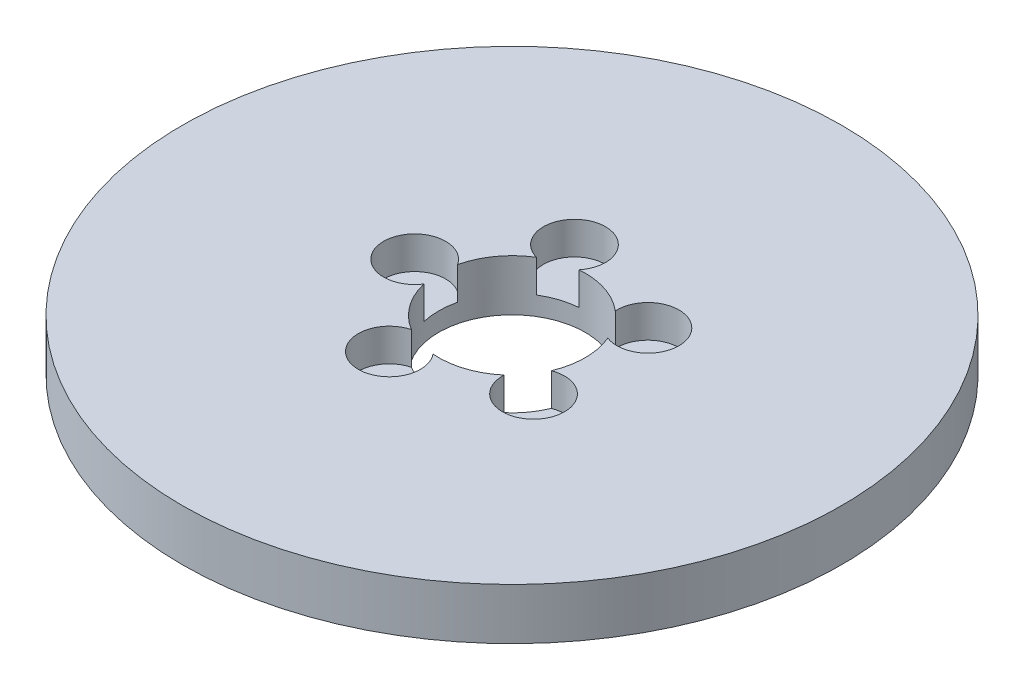
ISO-10303-21;
HEADER;
FILE_DESCRIPTION(('STEP AP214'),'2;1');
FILE_NAME('part.step','',(''),(''),'','','');
FILE_SCHEMA(('AUTOMOTIVE_DESIGN { 1 0 10303 214 1 1 1 1 }'));
ENDSEC;
DATA;
#1=APPLICATION_CONTEXT('core data for automotive mechanical design processes');
#2=APPLICATION_PROTOCOL_DEFINITION('international standard','automotive_design',2000,#1);
#3=PRODUCT_CONTEXT('',#1,'mechanical');
#4=PRODUCT('Part','Part','',(#3));
#5=PRODUCT_RELATED_PRODUCT_CATEGORY('part','',(#4));
#6=PRODUCT_DEFINITION_FORMATION('','',#4);
#7=PRODUCT_DEFINITION_CONTEXT('part definition',#1,'design');
#8=PRODUCT_DEFINITION('design','',#6,#7);
#9=PRODUCT_DEFINITION_SHAPE('','',#8);
#10=(LENGTH_UNIT() NAMED_UNIT(*) SI_UNIT(.MILLI.,.METRE.));
#11=(NAMED_UNIT(*) PLANE_ANGLE_UNIT() SI_UNIT($,.RADIAN.));
#12=(NAMED_UNIT(*) SI_UNIT($,.STERADIAN.) SOLID_ANGLE_UNIT());
#13=UNCERTAINTY_MEASURE_WITH_UNIT(LENGTH_MEASURE(1.E-05),#10,'distance_accuracy_value','');
#14=(GEOMETRIC_REPRESENTATION_CONTEXT(3) GLOBAL_UNCERTAINTY_ASSIGNED_CONTEXT((#13)) GLOBAL_UNIT_ASSIGNED_CONTEXT((#10,
#11,#12)) REPRESENTATION_CONTEXT('',''));
#15=CARTESIAN_POINT('',(0.,0.,0.));
#16=DIRECTION('',(0.,0.,1.));
#17=DIRECTION('',(1.,0.,0.));
#18=AXIS2_PLACEMENT_3D('',#15,#16,#17);
#19=CARTESIAN_POINT('',(0.,7.,0.));
#20=DIRECTION('',(0.,-1.,0.));
#21=DIRECTION('',(0.,0.,-1.));
#22=AXIS2_PLACEMENT_3D('',#19,#20,#21);
#23=CYLINDRICAL_SURFACE('',#22,45.);
#24=CARTESIAN_POINT('',(0.,7.,0.));
#25=DIRECTION('',(0.,1.,0.));
#26=DIRECTION('',(0.,0.,1.));
#27=AXIS2_PLACEMENT_3D('',#24,#25,#26);
#28=CIRCLE('',#27,45.);
#29=CARTESIAN_POINT('',(0.,7.,45.));
#30=VERTEX_POINT('',#29);
#31=EDGE_CURVE('E157',#30,#30,#28,.T.);
#32=ORIENTED_EDGE('',*,*,#31,.F.);
#33=EDGE_LOOP('',(#32));
#34=FACE_BOUND('',#33,.T.);
#35=CARTESIAN_POINT('',(0.,0.,0.));
#36=DIRECTION('',(0.,1.,0.));
#37=DIRECTION('',(0.,0.,1.));
#38=AXIS2_PLACEMENT_3D('',#35,#36,#37);
#39=CIRCLE('',#38,45.);
#40=CARTESIAN_POINT('',(0.,0.,45.));
#41=VERTEX_POINT('',#40);
#42=EDGE_CURVE('E150',#41,#41,#39,.T.);
#43=ORIENTED_EDGE('',*,*,#42,.T.);
#44=EDGE_LOOP('',(#43));
#45=FACE_BOUND('',#44,.T.);
#46=ADVANCED_FACE('F39',(#34,#45),#23,.T.);
#47=CARTESIAN_POINT('',(0.,7.,0.));
#48=DIRECTION('',(0.,1.,0.));
#49=DIRECTION('',(0.,0.,1.));
#50=AXIS2_PLACEMENT_3D('',#47,#48,#49);
#51=PLANE('',#50);
#52=CARTESIAN_POINT('',(-4.10640109321556,7.,-12.6382030416275));
#53=DIRECTION('',(0.,1.,0.));
#54=DIRECTION('',(-0.95105651629515,0.,0.309016994374958));
#55=AXIS2_PLACEMENT_3D('',#52,#53,#54);
#56=CIRCLE('',#55,4.23818412075947);
#57=CARTESIAN_POINT('',(-0.816280295025896,7.,-9.96662864161962));
#58=VERTEX_POINT('',#57);
#59=CARTESIAN_POINT('',(-5.19785269977062,7.,-8.54296946684742));
#60=VERTEX_POINT('',#59);
#61=EDGE_CURVE('E194',#58,#60,#56,.T.);
#62=ORIENTED_EDGE('',*,*,#61,.F.);
#63=CARTESIAN_POINT('',(0.,7.,0.));
#64=DIRECTION('',(0.,1.,0.));
#65=DIRECTION('',(0.,0.,1.));
#66=AXIS2_PLACEMENT_3D('',#63,#64,#65);
#67=CIRCLE('',#66,10.);
#68=CARTESIAN_POINT('',(6.51862196146897,7.,-7.58337442854133));
#69=VERTEX_POINT('',#68);
#70=EDGE_CURVE('E147',#69,#58,#67,.T.);
#71=ORIENTED_EDGE('',*,*,#70,.F.);
#72=CARTESIAN_POINT('',(10.7506976334776,7.,-7.81083903644823));
#73=DIRECTION('',(0.,1.,0.));
#74=DIRECTION('',(-0.58778525229248,0.,-0.809016994374942));
#75=AXIS2_PLACEMENT_3D('',#72,#73,#74);
#76=CIRCLE('',#75,4.23818412075947);
#77=CARTESIAN_POINT('',(9.22658263176986,7.,-3.85618632059224));
#78=VERTEX_POINT('',#77);
#79=EDGE_CURVE('E254',#78,#69,#76,.T.);
#80=ORIENTED_EDGE('',*,*,#79,.F.);
#81=CARTESIAN_POINT('',(9.22658263176992,7.,3.85618632059211));
#82=VERTEX_POINT('',#81);
#83=EDGE_CURVE('E144',#82,#78,#67,.T.);
#84=ORIENTED_EDGE('',*,*,#83,.F.);
#85=CARTESIAN_POINT('',(10.7506976334777,7.,7.81083903644807));
#86=DIRECTION('',(0.,1.,0.));
#87=DIRECTION('',(0.587785252292469,0.,-0.809016994374951));
#88=AXIS2_PLACEMENT_3D('',#85,#86,#87);
#89=CIRCLE('',#88,4.23818412075947);
#90=CARTESIAN_POINT('',(6.51862196146908,7.,7.58337442854123));
#91=VERTEX_POINT('',#90);
#92=EDGE_CURVE('E141',#91,#82,#89,.T.);
#93=ORIENTED_EDGE('',*,*,#92,.F.);
#94=CARTESIAN_POINT('',(-0.816280295025759,7.,9.96662864161963));
#95=VERTEX_POINT('',#94);
#96=EDGE_CURVE('E134',#95,#91,#67,.T.);
#97=ORIENTED_EDGE('',*,*,#96,.F.);
#98=CARTESIAN_POINT('',(-4.10640109321538,7.,12.6382030416276));
#99=DIRECTION('',(0.,1.,0.));
#100=DIRECTION('',(0.951056516295155,0.,0.309016994374945));
#101=AXIS2_PLACEMENT_3D('',#98,#99,#100);
#102=CIRCLE('',#101,4.23818412075947);
#103=CARTESIAN_POINT('',(-5.1978526997705,7.,8.5429694668475));
#104=VERTEX_POINT('',#103);
#105=EDGE_CURVE('E111',#104,#95,#102,.T.);
#106=ORIENTED_EDGE('',*,*,#105,.F.);
#107=CARTESIAN_POINT('',(-9.73107159844262,7.,2.30352893317696));
#108=VERTEX_POINT('',#107);
#109=EDGE_CURVE('E145',#108,#104,#67,.T.);
#110=ORIENTED_EDGE('',*,*,#109,.F.);
#111=CARTESIAN_POINT('',(-13.2885930805245,7.,0.));
#112=DIRECTION('',(0.,1.,0.));
#113=DIRECTION('',(0.,0.,1.));
#114=AXIS2_PLACEMENT_3D('',#111,#112,#113);
#115=CIRCLE('',#114,4.23818412075947);
#116=CARTESIAN_POINT('',(-9.73107159844262,7.,-2.30352893317696));
#117=VERTEX_POINT('',#116);
#118=EDGE_CURVE('E153',#117,#108,#115,.T.);
#119=ORIENTED_EDGE('',*,*,#118,.F.);
#120=EDGE_CURVE('E146',#60,#117,#67,.T.);
#121=ORIENTED_EDGE('',*,*,#120,.F.);
#122=EDGE_LOOP('',(#62,#71,#80,#84,#93,#97,#106,#110,#119,#121));
#123=FACE_BOUND('',#122,.T.);
#124=ORIENTED_EDGE('',*,*,#31,.T.);
#125=EDGE_LOOP('',(#124));
#126=FACE_BOUND('',#125,.T.);
#127=ADVANCED_FACE('F139',(#123,#126),#51,.T.);
#128=CARTESIAN_POINT('',(0.,0.,0.));
#129=DIRECTION('',(0.,1.,0.));
#130=DIRECTION('',(0.,0.,1.));
#131=AXIS2_PLACEMENT_3D('',#128,#129,#130);
#132=PLANE('',#131);
#133=CARTESIAN_POINT('',(0.,0.,0.));
#134=DIRECTION('',(0.,1.,0.));
#135=DIRECTION('',(0.,0.,1.));
#136=AXIS2_PLACEMENT_3D('',#133,#134,#135);
#137=CIRCLE('',#136,10.);
#138=CARTESIAN_POINT('',(0.,0.,10.));
#139=VERTEX_POINT('',#138);
#140=EDGE_CURVE('E154',#139,#139,#137,.T.);
#141=ORIENTED_EDGE('',*,*,#140,.T.);
#142=EDGE_LOOP('',(#141));
#143=FACE_BOUND('',#142,.T.);
#144=ORIENTED_EDGE('',*,*,#42,.F.);
#145=EDGE_LOOP('',(#144));
#146=FACE_BOUND('',#145,.T.);
#147=ADVANCED_FACE('F213',(#143,#146),#132,.F.);
#148=CARTESIAN_POINT('',(0.,7.,0.));
#149=DIRECTION('',(0.,-1.,0.));
#150=DIRECTION('',(0.,0.,-1.));
#151=AXIS2_PLACEMENT_3D('',#148,#149,#150);
#152=CYLINDRICAL_SURFACE('',#151,10.);
#153=DIRECTION('',(0.,1.,0.));
#154=VECTOR('',#153,1.);
#155=CARTESIAN_POINT('',(-0.816280295025898,4.77219444404928,-9.96662864161961));
#156=LINE('',#155,#154);
#157=CARTESIAN_POINT('',(-0.816280295025896,2.54438888809855,-9.96662864161962));
#158=VERTEX_POINT('',#157);
#159=EDGE_CURVE('E11',#158,#58,#156,.T.);
#160=ORIENTED_EDGE('',*,*,#159,.F.);
#161=CARTESIAN_POINT('',(0.,2.54438888809855,0.));
#162=DIRECTION('',(0.,1.,0.));
#163=DIRECTION('',(0.,0.,1.));
#164=AXIS2_PLACEMENT_3D('',#161,#162,#163);
#165=CIRCLE('',#164,10.);
#166=CARTESIAN_POINT('',(-5.19785269977062,2.54438888809855,-8.54296946684742));
#167=VERTEX_POINT('',#166);
#168=EDGE_CURVE('E189',#158,#167,#165,.T.);
#169=ORIENTED_EDGE('',*,*,#168,.T.);
#170=DIRECTION('',(0.,1.,0.));
#171=VECTOR('',#170,1.);
#172=CARTESIAN_POINT('',(-5.19785269977062,4.77219444404928,-8.54296946684742));
#173=LINE('',#172,#171);
#174=EDGE_CURVE('E46',#60,#167,#173,.F.);
#175=ORIENTED_EDGE('',*,*,#174,.F.);
#176=ORIENTED_EDGE('',*,*,#120,.T.);
#177=DIRECTION('',(0.,1.,0.));
#178=VECTOR('',#177,1.);
#179=CARTESIAN_POINT('',(-9.73107159844262,4.77219444404928,-2.30352893317696));
#180=LINE('',#179,#178);
#181=CARTESIAN_POINT('',(-9.73107159844262,2.54438888809855,-2.30352893317696));
#182=VERTEX_POINT('',#181);
#183=EDGE_CURVE('E168',#182,#117,#180,.T.);
#184=ORIENTED_EDGE('',*,*,#183,.F.);
#185=CARTESIAN_POINT('',(0.,2.54438888809855,0.));
#186=DIRECTION('',(0.,1.,0.));
#187=DIRECTION('',(0.,0.,1.));
#188=AXIS2_PLACEMENT_3D('',#185,#186,#187);
#189=CIRCLE('',#188,10.);
#190=CARTESIAN_POINT('',(-9.73107159844262,2.54438888809855,2.30352893317696));
#191=VERTEX_POINT('',#190);
#192=EDGE_CURVE('E165',#182,#191,#189,.T.);
#193=ORIENTED_EDGE('',*,*,#192,.T.);
#194=DIRECTION('',(0.,1.,0.));
#195=VECTOR('',#194,1.);
#196=CARTESIAN_POINT('',(-9.73107159844262,4.77219444404928,2.30352893317696));
#197=LINE('',#196,#195);
#198=EDGE_CURVE('E170',#108,#191,#197,.F.);
#199=ORIENTED_EDGE('',*,*,#198,.F.);
#200=ORIENTED_EDGE('',*,*,#109,.T.);
#201=DIRECTION('',(0.,1.,0.));
#202=VECTOR('',#201,1.);
#203=CARTESIAN_POINT('',(-5.19785269977049,4.77219444404928,8.54296946684749));
#204=LINE('',#203,#202);
#205=CARTESIAN_POINT('',(-5.1978526997705,2.54438888809855,8.5429694668475));
#206=VERTEX_POINT('',#205);
#207=EDGE_CURVE('E121',#206,#104,#204,.T.);
#208=ORIENTED_EDGE('',*,*,#207,.F.);
#209=CARTESIAN_POINT('',(0.,2.54438888809855,0.));
#210=DIRECTION('',(0.,1.,0.));
#211=DIRECTION('',(0.,0.,1.));
#212=AXIS2_PLACEMENT_3D('',#209,#210,#211);
#213=CIRCLE('',#212,10.);
#214=CARTESIAN_POINT('',(-0.816280295025759,2.54438888809855,9.96662864161963));
#215=VERTEX_POINT('',#214);
#216=EDGE_CURVE('E136',#206,#215,#213,.T.);
#217=ORIENTED_EDGE('',*,*,#216,.T.);
#218=DIRECTION('',(0.,1.,0.));
#219=VECTOR('',#218,1.);
#220=CARTESIAN_POINT('',(-0.81628029502576,4.77219444404928,9.96662864161962));
#221=LINE('',#220,#219);
#222=EDGE_CURVE('E117',#95,#215,#221,.F.);
#223=ORIENTED_EDGE('',*,*,#222,.F.);
#224=ORIENTED_EDGE('',*,*,#96,.T.);
#225=DIRECTION('',(0.,1.,0.));
#226=VECTOR('',#225,1.);
#227=CARTESIAN_POINT('',(6.51862196146908,4.77219444404928,7.58337442854123));
#228=LINE('',#227,#226);
#229=CARTESIAN_POINT('',(6.51862196146908,2.54438888809855,7.58337442854123));
#230=VERTEX_POINT('',#229);
#231=EDGE_CURVE('E182',#230,#91,#228,.T.);
#232=ORIENTED_EDGE('',*,*,#231,.F.);
#233=CARTESIAN_POINT('',(0.,2.54438888809855,0.));
#234=DIRECTION('',(0.,1.,0.));
#235=DIRECTION('',(0.,0.,1.));
#236=AXIS2_PLACEMENT_3D('',#233,#234,#235);
#237=CIRCLE('',#236,10.);
#238=CARTESIAN_POINT('',(9.22658263176992,2.54438888809855,3.85618632059211));
#239=VERTEX_POINT('',#238);
#240=EDGE_CURVE('E174',#230,#239,#237,.T.);
#241=ORIENTED_EDGE('',*,*,#240,.T.);
#242=DIRECTION('',(0.,1.,0.));
#243=VECTOR('',#242,1.);
#244=CARTESIAN_POINT('',(9.22658263176992,4.77219444404928,3.85618632059211));
#245=LINE('',#244,#243);
#246=EDGE_CURVE('E177',#82,#239,#245,.F.);
#247=ORIENTED_EDGE('',*,*,#246,.F.);
#248=ORIENTED_EDGE('',*,*,#83,.T.);
#249=DIRECTION('',(0.,1.,0.));
#250=VECTOR('',#249,1.);
#251=CARTESIAN_POINT('',(9.22658263176986,4.77219444404928,-3.85618632059224));
#252=LINE('',#251,#250);
#253=CARTESIAN_POINT('',(9.22658263176986,2.54438888809855,-3.85618632059224));
#254=VERTEX_POINT('',#253);
#255=EDGE_CURVE('E187',#254,#78,#252,.T.);
#256=ORIENTED_EDGE('',*,*,#255,.F.);
#257=CARTESIAN_POINT('',(0.,2.54438888809855,0.));
#258=DIRECTION('',(0.,1.,0.));
#259=DIRECTION('',(0.,0.,1.));
#260=AXIS2_PLACEMENT_3D('',#257,#258,#259);
#261=CIRCLE('',#260,10.);
#262=CARTESIAN_POINT('',(6.51862196146897,2.54438888809855,-7.58337442854133));
#263=VERTEX_POINT('',#262);
#264=EDGE_CURVE('E181',#254,#263,#261,.T.);
#265=ORIENTED_EDGE('',*,*,#264,.T.);
#266=DIRECTION('',(0.,1.,0.));
#267=VECTOR('',#266,1.);
#268=CARTESIAN_POINT('',(6.51862196146897,4.77219444404928,-7.58337442854132));
#269=LINE('',#268,#267);
#270=EDGE_CURVE('E186',#69,#263,#269,.F.);
#271=ORIENTED_EDGE('',*,*,#270,.F.);
#272=ORIENTED_EDGE('',*,*,#70,.T.);
#273=EDGE_LOOP('',(#160,#169,#175,#176,#184,#193,#199,#200,#208,#217,#223,#224,#232,#241,#247,
#248,#256,#265,#271,#272));
#274=FACE_BOUND('',#273,.T.);
#275=ORIENTED_EDGE('',*,*,#140,.F.);
#276=EDGE_LOOP('',(#275));
#277=FACE_BOUND('',#276,.T.);
#278=ADVANCED_FACE('F135',(#274,#277),#152,.F.);
#279=CARTESIAN_POINT('',(-13.2885930805245,2.54438888809855,0.));
#280=DIRECTION('',(0.,1.,0.));
#281=DIRECTION('',(0.,0.,1.));
#282=AXIS2_PLACEMENT_3D('',#279,#280,#281);
#283=CYLINDRICAL_SURFACE('',#282,4.23818412075947);
#284=ORIENTED_EDGE('',*,*,#183,.T.);
#285=ORIENTED_EDGE('',*,*,#118,.T.);
#286=ORIENTED_EDGE('',*,*,#198,.T.);
#287=CARTESIAN_POINT('',(-13.2885930805245,2.54438888809855,0.));
#288=DIRECTION('',(0.,1.,0.));
#289=DIRECTION('',(0.,0.,1.));
#290=AXIS2_PLACEMENT_3D('',#287,#288,#289);
#291=CIRCLE('',#290,4.23818412075947);
#292=EDGE_CURVE('E158',#182,#191,#291,.T.);
#293=ORIENTED_EDGE('',*,*,#292,.F.);
#294=EDGE_LOOP('',(#284,#285,#286,#293));
#295=FACE_BOUND('',#294,.T.);
#296=ADVANCED_FACE('F221',(#295),#283,.F.);
#297=CARTESIAN_POINT('',(-13.2885930805245,2.54438888809855,0.));
#298=DIRECTION('',(0.,1.,0.));
#299=DIRECTION('',(0.,0.,1.));
#300=AXIS2_PLACEMENT_3D('',#297,#298,#299);
#301=PLANE('',#300);
#302=ORIENTED_EDGE('',*,*,#292,.T.);
#303=ORIENTED_EDGE('',*,*,#192,.F.);
#304=EDGE_LOOP('',(#302,#303));
#305=FACE_BOUND('',#304,.T.);
#306=ADVANCED_FACE('F227',(#305),#301,.T.);
#307=CARTESIAN_POINT('',(-4.10640109321538,2.54438888809855,12.6382030416276));
#308=DIRECTION('',(0.,1.,0.));
#309=DIRECTION('',(0.,0.,1.));
#310=AXIS2_PLACEMENT_3D('',#307,#308,#309);
#311=CYLINDRICAL_SURFACE('',#310,4.23818412075947);
#312=ORIENTED_EDGE('',*,*,#207,.T.);
#313=ORIENTED_EDGE('',*,*,#105,.T.);
#314=ORIENTED_EDGE('',*,*,#222,.T.);
#315=CARTESIAN_POINT('',(-4.10640109321538,2.54438888809855,12.6382030416276));
#316=DIRECTION('',(0.,1.,0.));
#317=DIRECTION('',(0.951056516295155,0.,0.309016994374945));
#318=AXIS2_PLACEMENT_3D('',#315,#316,#317);
#319=CIRCLE('',#318,4.23818412075947);
#320=EDGE_CURVE('E127',#206,#215,#319,.T.);
#321=ORIENTED_EDGE('',*,*,#320,.F.);
#322=EDGE_LOOP('',(#312,#313,#314,#321));
#323=FACE_BOUND('',#322,.T.);
#324=ADVANCED_FACE('F116',(#323),#311,.F.);
#325=CARTESIAN_POINT('',(-4.10640109321538,2.54438888809855,12.6382030416276));
#326=DIRECTION('',(0.,1.,0.));
#327=DIRECTION('',(0.951056516295155,0.,0.309016994374945));
#328=AXIS2_PLACEMENT_3D('',#325,#326,#327);
#329=PLANE('',#328);
#330=ORIENTED_EDGE('',*,*,#320,.T.);
#331=ORIENTED_EDGE('',*,*,#216,.F.);
#332=EDGE_LOOP('',(#330,#331));
#333=FACE_BOUND('',#332,.T.);
#334=ADVANCED_FACE('F234',(#333),#329,.T.);
#335=CARTESIAN_POINT('',(10.7506976334777,2.54438888809855,7.81083903644807));
#336=DIRECTION('',(0.,1.,0.));
#337=DIRECTION('',(0.,0.,1.));
#338=AXIS2_PLACEMENT_3D('',#335,#336,#337);
#339=CYLINDRICAL_SURFACE('',#338,4.23818412075947);
#340=ORIENTED_EDGE('',*,*,#231,.T.);
#341=ORIENTED_EDGE('',*,*,#92,.T.);
#342=ORIENTED_EDGE('',*,*,#246,.T.);
#343=CARTESIAN_POINT('',(10.7506976334777,2.54438888809855,7.81083903644807));
#344=DIRECTION('',(0.,1.,0.));
#345=DIRECTION('',(0.587785252292469,0.,-0.809016994374951));
#346=AXIS2_PLACEMENT_3D('',#343,#344,#345);
#347=CIRCLE('',#346,4.23818412075947);
#348=EDGE_CURVE('E130',#230,#239,#347,.T.);
#349=ORIENTED_EDGE('',*,*,#348,.F.);
#350=EDGE_LOOP('',(#340,#341,#342,#349));
#351=FACE_BOUND('',#350,.T.);
#352=ADVANCED_FACE('F240',(#351),#339,.F.);
#353=CARTESIAN_POINT('',(10.7506976334777,2.54438888809855,7.81083903644807));
#354=DIRECTION('',(0.,1.,0.));
#355=DIRECTION('',(0.587785252292469,0.,-0.809016994374951));
#356=AXIS2_PLACEMENT_3D('',#353,#354,#355);
#357=PLANE('',#356);
#358=ORIENTED_EDGE('',*,*,#348,.T.);
#359=ORIENTED_EDGE('',*,*,#240,.F.);
#360=EDGE_LOOP('',(#358,#359));
#361=FACE_BOUND('',#360,.T.);
#362=ADVANCED_FACE('F245',(#361),#357,.T.);
#363=CARTESIAN_POINT('',(10.7506976334776,2.54438888809855,-7.81083903644823));
#364=DIRECTION('',(0.,1.,0.));
#365=DIRECTION('',(0.,0.,1.));
#366=AXIS2_PLACEMENT_3D('',#363,#364,#365);
#367=CYLINDRICAL_SURFACE('',#366,4.23818412075947);
#368=ORIENTED_EDGE('',*,*,#255,.T.);
#369=ORIENTED_EDGE('',*,*,#79,.T.);
#370=ORIENTED_EDGE('',*,*,#270,.T.);
#371=CARTESIAN_POINT('',(10.7506976334776,2.54438888809855,-7.81083903644823));
#372=DIRECTION('',(0.,1.,0.));
#373=DIRECTION('',(-0.58778525229248,0.,-0.809016994374942));
#374=AXIS2_PLACEMENT_3D('',#371,#372,#373);
#375=CIRCLE('',#374,4.23818412075947);
#376=EDGE_CURVE('E56',#254,#263,#375,.T.);
#377=ORIENTED_EDGE('',*,*,#376,.F.);
#378=EDGE_LOOP('',(#368,#369,#370,#377));
#379=FACE_BOUND('',#378,.T.);
#380=ADVANCED_FACE('F266',(#379),#367,.F.);
#381=CARTESIAN_POINT('',(10.7506976334776,2.54438888809855,-7.81083903644823));
#382=DIRECTION('',(0.,1.,0.));
#383=DIRECTION('',(-0.58778525229248,0.,-0.809016994374942));
#384=AXIS2_PLACEMENT_3D('',#381,#382,#383);
#385=PLANE('',#384);
#386=ORIENTED_EDGE('',*,*,#376,.T.);
#387=ORIENTED_EDGE('',*,*,#264,.F.);
#388=EDGE_LOOP('',(#386,#387));
#389=FACE_BOUND('',#388,.T.);
#390=ADVANCED_FACE('F204',(#389),#385,.T.);
#391=CARTESIAN_POINT('',(-4.10640109321556,2.54438888809855,-12.6382030416275));
#392=DIRECTION('',(0.,1.,0.));
#393=DIRECTION('',(0.,0.,1.));
#394=AXIS2_PLACEMENT_3D('',#391,#392,#393);
#395=CYLINDRICAL_SURFACE('',#394,4.23818412075947);
#396=ORIENTED_EDGE('',*,*,#159,.T.);
#397=ORIENTED_EDGE('',*,*,#61,.T.);
#398=ORIENTED_EDGE('',*,*,#174,.T.);
#399=CARTESIAN_POINT('',(-4.10640109321556,2.54438888809855,-12.6382030416275));
#400=DIRECTION('',(0.,1.,0.));
#401=DIRECTION('',(-0.95105651629515,0.,0.309016994374958));
#402=AXIS2_PLACEMENT_3D('',#399,#400,#401);
#403=CIRCLE('',#402,4.23818412075947);
#404=EDGE_CURVE('E55',#158,#167,#403,.T.);
#405=ORIENTED_EDGE('',*,*,#404,.F.);
#406=EDGE_LOOP('',(#396,#397,#398,#405));
#407=FACE_BOUND('',#406,.T.);
#408=ADVANCED_FACE('F193',(#407),#395,.F.);
#409=CARTESIAN_POINT('',(-4.10640109321556,2.54438888809855,-12.6382030416275));
#410=DIRECTION('',(0.,1.,0.));
#411=DIRECTION('',(-0.95105651629515,0.,0.309016994374958));
#412=AXIS2_PLACEMENT_3D('',#409,#410,#411);
#413=PLANE('',#412);
#414=ORIENTED_EDGE('',*,*,#404,.T.);
#415=ORIENTED_EDGE('',*,*,#168,.F.);
#416=EDGE_LOOP('',(#414,#415));
#417=FACE_BOUND('',#416,.T.);
#418=ADVANCED_FACE('F196',(#417),#413,.T.);
#419=CLOSED_SHELL('',(#46,#127,#147,#278,#296,#306,#324,#334,#352,#362,#380,#390,#408,#418));
#420=MANIFOLD_SOLID_BREP('B2',#419);
#421=ADVANCED_BREP_SHAPE_REPRESENTATION('',(#18,#420),#14);
#422=SHAPE_DEFINITION_REPRESENTATION(#9,#421);
ENDSEC;
END-ISO-10303-21;
